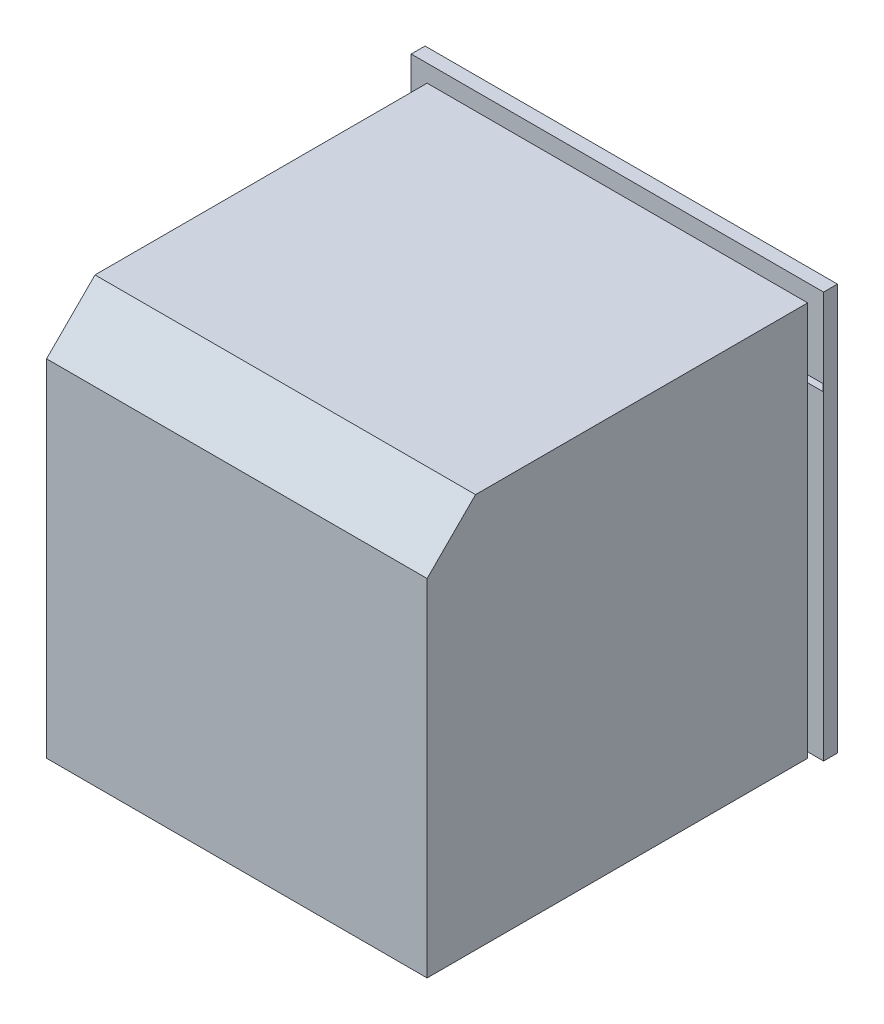
ISO-10303-21;
HEADER;
FILE_DESCRIPTION(('STEP AP214'),'2;1');
FILE_NAME('part.step','',(''),(''),'','','');
FILE_SCHEMA(('AUTOMOTIVE_DESIGN { 1 0 10303 214 1 1 1 1 }'));
ENDSEC;
DATA;
#1=APPLICATION_CONTEXT('core data for automotive mechanical design processes');
#2=APPLICATION_PROTOCOL_DEFINITION('international standard','automotive_design',2000,#1);
#3=PRODUCT_CONTEXT('',#1,'mechanical');
#4=PRODUCT('Part','Part','',(#3));
#5=PRODUCT_RELATED_PRODUCT_CATEGORY('part','',(#4));
#6=PRODUCT_DEFINITION_FORMATION('','',#4);
#7=PRODUCT_DEFINITION_CONTEXT('part definition',#1,'design');
#8=PRODUCT_DEFINITION('design','',#6,#7);
#9=PRODUCT_DEFINITION_SHAPE('','',#8);
#10=(LENGTH_UNIT() NAMED_UNIT(*) SI_UNIT(.MILLI.,.METRE.));
#11=(NAMED_UNIT(*) PLANE_ANGLE_UNIT() SI_UNIT($,.RADIAN.));
#12=(NAMED_UNIT(*) SI_UNIT($,.STERADIAN.) SOLID_ANGLE_UNIT());
#13=UNCERTAINTY_MEASURE_WITH_UNIT(LENGTH_MEASURE(1.E-05),#10,'distance_accuracy_value','');
#14=(GEOMETRIC_REPRESENTATION_CONTEXT(3) GLOBAL_UNCERTAINTY_ASSIGNED_CONTEXT((#13)) GLOBAL_UNIT_ASSIGNED_CONTEXT((#10,
#11,#12)) REPRESENTATION_CONTEXT('',''));
#15=CARTESIAN_POINT('',(0.,0.,0.));
#16=DIRECTION('',(0.,0.,1.));
#17=DIRECTION('',(1.,0.,0.));
#18=AXIS2_PLACEMENT_3D('',#15,#16,#17);
#19=CARTESIAN_POINT('',(-209.116922128555,438.707988465642,-61.3242226126102));
#20=DIRECTION('',(0.,0.,-1.));
#21=DIRECTION('',(-1.,0.,0.));
#22=AXIS2_PLACEMENT_3D('',#19,#20,#21);
#23=PLANE('',#22);
#24=DIRECTION('',(-1.,0.,0.));
#25=VECTOR('',#24,1.);
#26=CARTESIAN_POINT('',(-209.116922128555,468.707988465642,-61.3242226126102));
#27=LINE('',#26,#25);
#28=CARTESIAN_POINT('',(220.883077871445,468.707988465642,-61.3242226126102));
#29=VERTEX_POINT('',#28);
#30=CARTESIAN_POINT('',(-209.116922128555,468.707988465642,-61.3242226126102));
#31=VERTEX_POINT('',#30);
#32=EDGE_CURVE('E156',#29,#31,#27,.T.);
#33=ORIENTED_EDGE('',*,*,#32,.F.);
#34=DIRECTION('',(0.,1.,0.));
#35=VECTOR('',#34,1.);
#36=CARTESIAN_POINT('',(220.883077871445,438.707988465642,-61.3242226126102));
#37=LINE('',#36,#35);
#38=CARTESIAN_POINT('',(220.883077871445,438.707988465642,-61.3242226126102));
#39=VERTEX_POINT('',#38);
#40=EDGE_CURVE('E55',#39,#29,#37,.T.);
#41=ORIENTED_EDGE('',*,*,#40,.F.);
#42=DIRECTION('',(-1.,0.,0.));
#43=VECTOR('',#42,1.);
#44=CARTESIAN_POINT('',(-209.116922128555,438.707988465642,-61.3242226126102));
#45=LINE('',#44,#43);
#46=CARTESIAN_POINT('',(-209.116922128555,438.707988465642,-61.3242226126102));
#47=VERTEX_POINT('',#46);
#48=EDGE_CURVE('E130',#39,#47,#45,.T.);
#49=ORIENTED_EDGE('',*,*,#48,.T.);
#50=DIRECTION('',(0.,1.,0.));
#51=VECTOR('',#50,1.);
#52=CARTESIAN_POINT('',(-209.116922128555,438.707988465642,-61.3242226126102));
#53=LINE('',#52,#51);
#54=EDGE_CURVE('E12',#47,#31,#53,.T.);
#55=ORIENTED_EDGE('',*,*,#54,.T.);
#56=EDGE_LOOP('',(#33,#41,#49,#55));
#57=FACE_BOUND('',#56,.T.);
#58=ADVANCED_FACE('F45',(#57),#23,.T.);
#59=CARTESIAN_POINT('',(220.883077871445,438.707988465642,-61.3242226126102));
#60=DIRECTION('',(1.,0.,0.));
#61=DIRECTION('',(0.,1.,0.));
#62=AXIS2_PLACEMENT_3D('',#59,#60,#61);
#63=PLANE('',#62);
#64=DIRECTION('',(0.,0.,-1.));
#65=VECTOR('',#64,1.);
#66=CARTESIAN_POINT('',(220.883077871445,468.707988465642,-61.3242226126102));
#67=LINE('',#66,#65);
#68=CARTESIAN_POINT('',(220.883077871445,468.707988465642,-20.01));
#69=VERTEX_POINT('',#68);
#70=EDGE_CURVE('E115',#69,#29,#67,.T.);
#71=ORIENTED_EDGE('',*,*,#70,.F.);
#72=DIRECTION('',(0.,1.,0.));
#73=VECTOR('',#72,1.);
#74=CARTESIAN_POINT('',(220.883077871445,438.707988465642,-20.01));
#75=LINE('',#74,#73);
#76=CARTESIAN_POINT('',(220.883077871445,438.707988465642,-20.01));
#77=VERTEX_POINT('',#76);
#78=EDGE_CURVE('E111',#77,#69,#75,.T.);
#79=ORIENTED_EDGE('',*,*,#78,.F.);
#80=DIRECTION('',(0.,0.,-1.));
#81=VECTOR('',#80,1.);
#82=CARTESIAN_POINT('',(220.883077871445,438.707988465642,-46.3242226126102));
#83=LINE('',#82,#81);
#84=EDGE_CURVE('E114',#77,#39,#83,.T.);
#85=ORIENTED_EDGE('',*,*,#84,.T.);
#86=ORIENTED_EDGE('',*,*,#40,.T.);
#87=EDGE_LOOP('',(#71,#79,#85,#86));
#88=FACE_BOUND('',#87,.T.);
#89=ADVANCED_FACE('F113',(#88),#63,.T.);
#90=CARTESIAN_POINT('',(220.883077871445,438.707988465642,-20.01));
#91=DIRECTION('',(0.,0.,1.));
#92=DIRECTION('',(1.,0.,0.));
#93=AXIS2_PLACEMENT_3D('',#90,#91,#92);
#94=PLANE('',#93);
#95=DIRECTION('',(1.,0.,0.));
#96=VECTOR('',#95,1.);
#97=CARTESIAN_POINT('',(220.883077871445,468.707988465642,-20.01));
#98=LINE('',#97,#96);
#99=CARTESIAN_POINT('',(200.883077871445,468.707988465642,-20.01));
#100=VERTEX_POINT('',#99);
#101=EDGE_CURVE('E153',#100,#69,#98,.T.);
#102=ORIENTED_EDGE('',*,*,#101,.F.);
#103=DIRECTION('',(0.,1.,0.));
#104=VECTOR('',#103,1.);
#105=CARTESIAN_POINT('',(200.883077871445,438.707988465642,-20.01));
#106=LINE('',#105,#104);
#107=CARTESIAN_POINT('',(200.883077871445,438.707988465642,-20.01));
#108=VERTEX_POINT('',#107);
#109=EDGE_CURVE('E120',#108,#100,#106,.T.);
#110=ORIENTED_EDGE('',*,*,#109,.F.);
#111=DIRECTION('',(1.,0.,0.));
#112=VECTOR('',#111,1.);
#113=CARTESIAN_POINT('',(220.883077871445,438.707988465642,-20.01));
#114=LINE('',#113,#112);
#115=EDGE_CURVE('E127',#108,#77,#114,.T.);
#116=ORIENTED_EDGE('',*,*,#115,.T.);
#117=ORIENTED_EDGE('',*,*,#78,.T.);
#118=EDGE_LOOP('',(#102,#110,#116,#117));
#119=FACE_BOUND('',#118,.T.);
#120=ADVANCED_FACE('F132',(#119),#94,.T.);
#121=CARTESIAN_POINT('',(200.883077871445,438.707988465642,-46.3242226126102));
#122=DIRECTION('',(-1.,0.,0.));
#123=DIRECTION('',(0.,-1.,0.));
#124=AXIS2_PLACEMENT_3D('',#121,#122,#123);
#125=PLANE('',#124);
#126=DIRECTION('',(0.,0.,1.));
#127=VECTOR('',#126,1.);
#128=CARTESIAN_POINT('',(200.883077871445,468.707988465642,-46.3242226126102));
#129=LINE('',#128,#127);
#130=CARTESIAN_POINT('',(200.883077871445,468.707988465642,-46.3242226126102));
#131=VERTEX_POINT('',#130);
#132=EDGE_CURVE('E150',#131,#100,#129,.T.);
#133=ORIENTED_EDGE('',*,*,#132,.F.);
#134=DIRECTION('',(0.,1.,0.));
#135=VECTOR('',#134,1.);
#136=CARTESIAN_POINT('',(200.883077871445,438.707988465642,-46.3242226126102));
#137=LINE('',#136,#135);
#138=CARTESIAN_POINT('',(200.883077871445,438.707988465642,-46.3242226126102));
#139=VERTEX_POINT('',#138);
#140=EDGE_CURVE('E161',#139,#131,#137,.T.);
#141=ORIENTED_EDGE('',*,*,#140,.F.);
#142=DIRECTION('',(0.,0.,1.));
#143=VECTOR('',#142,1.);
#144=CARTESIAN_POINT('',(200.883077871445,438.707988465642,-46.3242226126102));
#145=LINE('',#144,#143);
#146=EDGE_CURVE('E133',#139,#108,#145,.T.);
#147=ORIENTED_EDGE('',*,*,#146,.T.);
#148=ORIENTED_EDGE('',*,*,#109,.T.);
#149=EDGE_LOOP('',(#133,#141,#147,#148));
#150=FACE_BOUND('',#149,.T.);
#151=ADVANCED_FACE('F186',(#150),#125,.T.);
#152=CARTESIAN_POINT('',(-189.116922128555,438.707988465642,-46.3242226126102));
#153=DIRECTION('',(0.,0.,1.));
#154=DIRECTION('',(1.,0.,0.));
#155=AXIS2_PLACEMENT_3D('',#152,#153,#154);
#156=PLANE('',#155);
#157=DIRECTION('',(1.,0.,0.));
#158=VECTOR('',#157,1.);
#159=CARTESIAN_POINT('',(-189.116922128555,468.707988465642,-46.3242226126102));
#160=LINE('',#159,#158);
#161=CARTESIAN_POINT('',(-189.116922128555,468.707988465642,-46.3242226126102));
#162=VERTEX_POINT('',#161);
#163=EDGE_CURVE('E147',#162,#131,#160,.T.);
#164=ORIENTED_EDGE('',*,*,#163,.F.);
#165=DIRECTION('',(0.,1.,0.));
#166=VECTOR('',#165,1.);
#167=CARTESIAN_POINT('',(-189.116922128555,438.707988465642,-46.3242226126102));
#168=LINE('',#167,#166);
#169=CARTESIAN_POINT('',(-189.116922128555,438.707988465642,-46.3242226126102));
#170=VERTEX_POINT('',#169);
#171=EDGE_CURVE('E163',#170,#162,#168,.T.);
#172=ORIENTED_EDGE('',*,*,#171,.F.);
#173=DIRECTION('',(1.,0.,0.));
#174=VECTOR('',#173,1.);
#175=CARTESIAN_POINT('',(-189.116922128555,438.707988465642,-46.3242226126102));
#176=LINE('',#175,#174);
#177=EDGE_CURVE('E135',#170,#139,#176,.T.);
#178=ORIENTED_EDGE('',*,*,#177,.T.);
#179=ORIENTED_EDGE('',*,*,#140,.T.);
#180=EDGE_LOOP('',(#164,#172,#178,#179));
#181=FACE_BOUND('',#180,.T.);
#182=ADVANCED_FACE('F189',(#181),#156,.T.);
#183=CARTESIAN_POINT('',(-189.116922128555,438.707988465642,-46.3242226126102));
#184=DIRECTION('',(1.,0.,0.));
#185=DIRECTION('',(0.,1.,0.));
#186=AXIS2_PLACEMENT_3D('',#183,#184,#185);
#187=PLANE('',#186);
#188=DIRECTION('',(0.,0.,-1.));
#189=VECTOR('',#188,1.);
#190=CARTESIAN_POINT('',(-189.116922128555,468.707988465642,-46.3242226126102));
#191=LINE('',#190,#189);
#192=CARTESIAN_POINT('',(-189.116922128555,468.707988465642,-20.01));
#193=VERTEX_POINT('',#192);
#194=EDGE_CURVE('E144',#193,#162,#191,.T.);
#195=ORIENTED_EDGE('',*,*,#194,.F.);
#196=DIRECTION('',(0.,1.,0.));
#197=VECTOR('',#196,1.);
#198=CARTESIAN_POINT('',(-189.116922128555,438.707988465642,-20.01));
#199=LINE('',#198,#197);
#200=CARTESIAN_POINT('',(-189.116922128555,438.707988465642,-20.01));
#201=VERTEX_POINT('',#200);
#202=EDGE_CURVE('E164',#201,#193,#199,.T.);
#203=ORIENTED_EDGE('',*,*,#202,.F.);
#204=DIRECTION('',(0.,0.,-1.));
#205=VECTOR('',#204,1.);
#206=CARTESIAN_POINT('',(-189.116922128555,438.707988465642,-46.3242226126102));
#207=LINE('',#206,#205);
#208=EDGE_CURVE('E273',#201,#170,#207,.T.);
#209=ORIENTED_EDGE('',*,*,#208,.T.);
#210=ORIENTED_EDGE('',*,*,#171,.T.);
#211=EDGE_LOOP('',(#195,#203,#209,#210));
#212=FACE_BOUND('',#211,.T.);
#213=ADVANCED_FACE('F193',(#212),#187,.T.);
#214=CARTESIAN_POINT('',(-209.116922128555,438.707988465642,-20.01));
#215=DIRECTION('',(0.,0.,1.));
#216=DIRECTION('',(1.,0.,0.));
#217=AXIS2_PLACEMENT_3D('',#214,#215,#216);
#218=PLANE('',#217);
#219=DIRECTION('',(1.,0.,0.));
#220=VECTOR('',#219,1.);
#221=CARTESIAN_POINT('',(-209.116922128555,468.707988465642,-20.01));
#222=LINE('',#221,#220);
#223=CARTESIAN_POINT('',(-209.116922128555,468.707988465642,-20.01));
#224=VERTEX_POINT('',#223);
#225=EDGE_CURVE('E141',#224,#193,#222,.T.);
#226=ORIENTED_EDGE('',*,*,#225,.F.);
#227=DIRECTION('',(0.,1.,0.));
#228=VECTOR('',#227,1.);
#229=CARTESIAN_POINT('',(-209.116922128555,438.707988465642,-20.01));
#230=LINE('',#229,#228);
#231=CARTESIAN_POINT('',(-209.116922128555,438.707988465642,-20.01));
#232=VERTEX_POINT('',#231);
#233=EDGE_CURVE('E49',#232,#224,#230,.T.);
#234=ORIENTED_EDGE('',*,*,#233,.F.);
#235=DIRECTION('',(1.,0.,0.));
#236=VECTOR('',#235,1.);
#237=CARTESIAN_POINT('',(-209.116922128555,438.707988465642,-20.01));
#238=LINE('',#237,#236);
#239=EDGE_CURVE('E274',#232,#201,#238,.T.);
#240=ORIENTED_EDGE('',*,*,#239,.T.);
#241=ORIENTED_EDGE('',*,*,#202,.T.);
#242=EDGE_LOOP('',(#226,#234,#240,#241));
#243=FACE_BOUND('',#242,.T.);
#244=ADVANCED_FACE('F170',(#243),#218,.T.);
#245=CARTESIAN_POINT('',(-209.116922128555,438.707988465642,-46.3242226126102));
#246=DIRECTION('',(-1.,0.,0.));
#247=DIRECTION('',(0.,-1.,0.));
#248=AXIS2_PLACEMENT_3D('',#245,#246,#247);
#249=PLANE('',#248);
#250=DIRECTION('',(0.,0.,1.));
#251=VECTOR('',#250,1.);
#252=CARTESIAN_POINT('',(-209.116922128555,468.707988465642,-46.3242226126102));
#253=LINE('',#252,#251);
#254=EDGE_CURVE('E93',#31,#224,#253,.T.);
#255=ORIENTED_EDGE('',*,*,#254,.F.);
#256=ORIENTED_EDGE('',*,*,#54,.F.);
#257=DIRECTION('',(0.,0.,1.));
#258=VECTOR('',#257,1.);
#259=CARTESIAN_POINT('',(-209.116922128555,438.707988465642,-61.3242226126102));
#260=LINE('',#259,#258);
#261=EDGE_CURVE('E96',#47,#232,#260,.T.);
#262=ORIENTED_EDGE('',*,*,#261,.T.);
#263=ORIENTED_EDGE('',*,*,#233,.T.);
#264=EDGE_LOOP('',(#255,#256,#262,#263));
#265=FACE_BOUND('',#264,.T.);
#266=ADVANCED_FACE('F47',(#265),#249,.T.);
#267=CARTESIAN_POINT('',(0.,438.707988465642,0.));
#268=DIRECTION('',(0.,1.,0.));
#269=DIRECTION('',(0.,0.,1.));
#270=AXIS2_PLACEMENT_3D('',#267,#268,#269);
#271=PLANE('',#270);
#272=ORIENTED_EDGE('',*,*,#261,.F.);
#273=ORIENTED_EDGE('',*,*,#48,.F.);
#274=ORIENTED_EDGE('',*,*,#84,.F.);
#275=ORIENTED_EDGE('',*,*,#115,.F.);
#276=ORIENTED_EDGE('',*,*,#146,.F.);
#277=ORIENTED_EDGE('',*,*,#177,.F.);
#278=ORIENTED_EDGE('',*,*,#208,.F.);
#279=ORIENTED_EDGE('',*,*,#239,.F.);
#280=EDGE_LOOP('',(#272,#273,#274,#275,#276,#277,#278,#279));
#281=FACE_BOUND('',#280,.T.);
#282=ADVANCED_FACE('F125',(#281),#271,.F.);
#283=CARTESIAN_POINT('',(0.,468.707988465642,0.));
#284=DIRECTION('',(0.,1.,0.));
#285=DIRECTION('',(0.,0.,1.));
#286=AXIS2_PLACEMENT_3D('',#283,#284,#285);
#287=PLANE('',#286);
#288=ORIENTED_EDGE('',*,*,#32,.T.);
#289=ORIENTED_EDGE('',*,*,#254,.T.);
#290=ORIENTED_EDGE('',*,*,#225,.T.);
#291=ORIENTED_EDGE('',*,*,#194,.T.);
#292=ORIENTED_EDGE('',*,*,#163,.T.);
#293=ORIENTED_EDGE('',*,*,#132,.T.);
#294=ORIENTED_EDGE('',*,*,#101,.T.);
#295=ORIENTED_EDGE('',*,*,#70,.T.);
#296=EDGE_LOOP('',(#288,#289,#290,#291,#292,#293,#294,#295));
#297=FACE_BOUND('',#296,.T.);
#298=ADVANCED_FACE('F172',(#297),#287,.T.);
#299=CLOSED_SHELL('',(#58,#89,#120,#151,#182,#213,#244,#266,#282,#298));
#300=MANIFOLD_SOLID_BREP('B2',#299);
#301=CARTESIAN_POINT('',(275.,8.70798846564201,550.));
#302=DIRECTION('',(0.,1.,0.));
#303=DIRECTION('',(-1.,0.,0.));
#304=AXIS2_PLACEMENT_3D('',#301,#302,#303);
#305=PLANE('',#304);
#306=DIRECTION('',(-1.,0.,0.));
#307=VECTOR('',#306,1.);
#308=CARTESIAN_POINT('',(-298.,8.70798846564191,-20.));
#309=LINE('',#308,#307);
#310=CARTESIAN_POINT('',(-297.,8.70798846564184,-20.));
#311=VERTEX_POINT('',#310);
#312=CARTESIAN_POINT('',(-298.,8.70798846564191,-20.));
#313=VERTEX_POINT('',#312);
#314=EDGE_CURVE('E536',#311,#313,#309,.T.);
#315=ORIENTED_EDGE('',*,*,#314,.F.);
#316=DIRECTION('',(0.,0.,-1.));
#317=VECTOR('',#316,1.);
#318=CARTESIAN_POINT('',(-297.,8.70798846564184,0.));
#319=LINE('',#318,#317);
#320=CARTESIAN_POINT('',(-297.,8.70798846564184,0.));
#321=VERTEX_POINT('',#320);
#322=EDGE_CURVE('E484',#321,#311,#319,.T.);
#323=ORIENTED_EDGE('',*,*,#322,.F.);
#324=DIRECTION('',(-1.,0.,0.));
#325=VECTOR('',#324,1.);
#326=CARTESIAN_POINT('',(-298.,8.70798846564191,0.));
#327=LINE('',#326,#325);
#328=CARTESIAN_POINT('',(-298.,8.70798846564191,0.));
#329=VERTEX_POINT('',#328);
#330=EDGE_CURVE('E570',#321,#329,#327,.T.);
#331=ORIENTED_EDGE('',*,*,#330,.T.);
#332=DIRECTION('',(0.,0.,1.));
#333=VECTOR('',#332,1.);
#334=CARTESIAN_POINT('',(-298.,8.70798846564191,-20.));
#335=LINE('',#334,#333);
#336=EDGE_CURVE('E645',#313,#329,#335,.T.);
#337=ORIENTED_EDGE('',*,*,#336,.F.);
#338=EDGE_LOOP('',(#315,#323,#331,#337));
#339=FACE_BOUND('',#338,.T.);
#340=ADVANCED_FACE('F281',(#339),#305,.F.);
#341=CARTESIAN_POINT('',(0.,0.,-20.));
#342=DIRECTION('',(0.,0.,-1.));
#343=DIRECTION('',(-1.,0.,0.));
#344=AXIS2_PLACEMENT_3D('',#341,#342,#343);
#345=PLANE('',#344);
#346=DIRECTION('',(0.,1.,0.));
#347=VECTOR('',#346,1.);
#348=CARTESIAN_POINT('',(-297.,0.,-20.));
#349=LINE('',#348,#347);
#350=CARTESIAN_POINT('',(-297.,478.707988465642,-20.));
#351=VERTEX_POINT('',#350);
#352=CARTESIAN_POINT('',(-297.,488.707988465642,-20.));
#353=VERTEX_POINT('',#352);
#354=EDGE_CURVE('E438',#351,#353,#349,.T.);
#355=ORIENTED_EDGE('',*,*,#354,.F.);
#356=DIRECTION('',(-1.,0.,0.));
#357=VECTOR('',#356,1.);
#358=CARTESIAN_POINT('',(0.,478.707988465642,-20.));
#359=LINE('',#358,#357);
#360=CARTESIAN_POINT('',(297.,478.707988465642,-20.));
#361=VERTEX_POINT('',#360);
#362=EDGE_CURVE('E470',#361,#351,#359,.T.);
#363=ORIENTED_EDGE('',*,*,#362,.F.);
#364=DIRECTION('',(0.,-1.,0.));
#365=VECTOR('',#364,1.);
#366=CARTESIAN_POINT('',(297.,0.,-20.));
#367=LINE('',#366,#365);
#368=CARTESIAN_POINT('',(297.,488.707988465642,-20.));
#369=VERTEX_POINT('',#368);
#370=EDGE_CURVE('E468',#369,#361,#367,.T.);
#371=ORIENTED_EDGE('',*,*,#370,.F.);
#372=DIRECTION('',(1.,0.,0.));
#373=VECTOR('',#372,1.);
#374=CARTESIAN_POINT('',(0.,488.707988465642,-20.));
#375=LINE('',#374,#373);
#376=EDGE_CURVE('E462',#353,#369,#375,.T.);
#377=ORIENTED_EDGE('',*,*,#376,.F.);
#378=EDGE_LOOP('',(#355,#363,#371,#377));
#379=FACE_BOUND('',#378,.T.);
#380=DIRECTION('',(0.,1.,0.));
#381=VECTOR('',#380,1.);
#382=CARTESIAN_POINT('',(-298.,8.70798846564191,-20.));
#383=LINE('',#382,#381);
#384=CARTESIAN_POINT('',(-298.,585.707988465642,-20.));
#385=VERTEX_POINT('',#384);
#386=EDGE_CURVE('E543',#313,#385,#383,.T.);
#387=ORIENTED_EDGE('',*,*,#386,.T.);
#388=DIRECTION('',(-1.,0.,0.));
#389=VECTOR('',#388,1.);
#390=CARTESIAN_POINT('',(298.,585.707988465642,-20.));
#391=LINE('',#390,#389);
#392=CARTESIAN_POINT('',(298.,585.707988465642,-20.));
#393=VERTEX_POINT('',#392);
#394=EDGE_CURVE('E492',#393,#385,#391,.T.);
#395=ORIENTED_EDGE('',*,*,#394,.F.);
#396=DIRECTION('',(0.,-1.,0.));
#397=VECTOR('',#396,1.);
#398=CARTESIAN_POINT('',(298.,8.70798846564184,-20.));
#399=LINE('',#398,#397);
#400=CARTESIAN_POINT('',(298.,60.7079884656419,-20.));
#401=VERTEX_POINT('',#400);
#402=EDGE_CURVE('E534',#393,#401,#399,.T.);
#403=ORIENTED_EDGE('',*,*,#402,.T.);
#404=DIRECTION('',(1.,0.,0.));
#405=VECTOR('',#404,1.);
#406=CARTESIAN_POINT('',(-297.,60.7079884656419,-20.));
#407=LINE('',#406,#405);
#408=CARTESIAN_POINT('',(-297.,60.7079884656419,-20.));
#409=VERTEX_POINT('',#408);
#410=EDGE_CURVE('E514',#409,#401,#407,.T.);
#411=ORIENTED_EDGE('',*,*,#410,.F.);
#412=DIRECTION('',(0.,1.,0.));
#413=VECTOR('',#412,1.);
#414=CARTESIAN_POINT('',(-297.,60.7079884656419,-20.));
#415=LINE('',#414,#413);
#416=CARTESIAN_POINT('',(-297.,16.7079884656418,-20.));
#417=VERTEX_POINT('',#416);
#418=EDGE_CURVE('E509',#417,#409,#415,.T.);
#419=ORIENTED_EDGE('',*,*,#418,.F.);
#420=EDGE_CURVE('E527',#311,#417,#415,.T.);
#421=ORIENTED_EDGE('',*,*,#420,.F.);
#422=ORIENTED_EDGE('',*,*,#314,.T.);
#423=EDGE_LOOP('',(#387,#395,#403,#411,#419,#421,#422));
#424=FACE_BOUND('',#423,.T.);
#425=ADVANCED_FACE('F563',(#379,#424),#345,.T.);
#426=CARTESIAN_POINT('',(-275.,8.70798846564191,550.));
#427=DIRECTION('',(1.,0.,0.));
#428=DIRECTION('',(0.,0.,-1.));
#429=AXIS2_PLACEMENT_3D('',#426,#427,#428);
#430=PLANE('',#429);
#431=DIRECTION('',(0.,-1.,0.));
#432=VECTOR('',#431,1.);
#433=CARTESIAN_POINT('',(-275.,8.70798846564191,550.));
#434=LINE('',#433,#432);
#435=CARTESIAN_POINT('',(-275.,508.707988465642,550.));
#436=VERTEX_POINT('',#435);
#437=CARTESIAN_POINT('',(-275.,8.70798846564191,550.));
#438=VERTEX_POINT('',#437);
#439=EDGE_CURVE('E660',#436,#438,#434,.T.);
#440=ORIENTED_EDGE('',*,*,#439,.F.);
#441=DIRECTION('',(0.,0.707106781186546,-0.707106781186549));
#442=VECTOR('',#441,1.);
#443=CARTESIAN_POINT('',(-275.,508.707988465642,550.));
#444=LINE('',#443,#442);
#445=CARTESIAN_POINT('',(-275.,578.707988465642,480.));
#446=VERTEX_POINT('',#445);
#447=EDGE_CURVE('E613',#436,#446,#444,.T.);
#448=ORIENTED_EDGE('',*,*,#447,.T.);
#449=DIRECTION('',(0.,0.,-1.));
#450=VECTOR('',#449,1.);
#451=CARTESIAN_POINT('',(-275.,578.707988465642,550.));
#452=LINE('',#451,#450);
#453=CARTESIAN_POINT('',(-275.,578.707988465642,0.));
#454=VERTEX_POINT('',#453);
#455=EDGE_CURVE('E663',#446,#454,#452,.T.);
#456=ORIENTED_EDGE('',*,*,#455,.T.);
#457=DIRECTION('',(0.,-1.,0.));
#458=VECTOR('',#457,1.);
#459=CARTESIAN_POINT('',(-275.,8.70798846564191,0.));
#460=LINE('',#459,#458);
#461=CARTESIAN_POINT('',(-275.,488.707988465642,0.));
#462=VERTEX_POINT('',#461);
#463=EDGE_CURVE('E547',#454,#462,#460,.T.);
#464=ORIENTED_EDGE('',*,*,#463,.T.);
#465=CARTESIAN_POINT('',(-275.,478.707988465642,0.));
#466=VERTEX_POINT('',#465);
#467=EDGE_CURVE('E633',#462,#466,#460,.T.);
#468=ORIENTED_EDGE('',*,*,#467,.T.);
#469=CARTESIAN_POINT('',(-275.,16.7079884656418,0.));
#470=VERTEX_POINT('',#469);
#471=EDGE_CURVE('E632',#466,#470,#460,.T.);
#472=ORIENTED_EDGE('',*,*,#471,.T.);
#473=CARTESIAN_POINT('',(-275.,8.70798846564184,0.));
#474=VERTEX_POINT('',#473);
#475=EDGE_CURVE('E634',#470,#474,#460,.T.);
#476=ORIENTED_EDGE('',*,*,#475,.T.);
#477=DIRECTION('',(0.,0.,-1.));
#478=VECTOR('',#477,1.);
#479=CARTESIAN_POINT('',(-275.,8.70798846564191,550.));
#480=LINE('',#479,#478);
#481=EDGE_CURVE('E601',#438,#474,#480,.T.);
#482=ORIENTED_EDGE('',*,*,#481,.F.);
#483=EDGE_LOOP('',(#440,#448,#456,#464,#468,#472,#476,#482));
#484=FACE_BOUND('',#483,.T.);
#485=ADVANCED_FACE('F674',(#484),#430,.F.);
#486=ORIENTED_EDGE('',*,*,#481,.T.);
#487=DIRECTION('',(-1.,0.,0.));
#488=VECTOR('',#487,1.);
#489=CARTESIAN_POINT('',(298.,8.70798846564184,0.));
#490=LINE('',#489,#488);
#491=CARTESIAN_POINT('',(275.,8.70798846564184,0.));
#492=VERTEX_POINT('',#491);
#493=EDGE_CURVE('E479',#492,#474,#490,.T.);
#494=ORIENTED_EDGE('',*,*,#493,.F.);
#495=DIRECTION('',(0.,0.,-1.));
#496=VECTOR('',#495,1.);
#497=CARTESIAN_POINT('',(275.,8.70798846564201,550.));
#498=LINE('',#497,#496);
#499=CARTESIAN_POINT('',(275.,8.70798846564201,550.));
#500=VERTEX_POINT('',#499);
#501=EDGE_CURVE('E595',#500,#492,#498,.T.);
#502=ORIENTED_EDGE('',*,*,#501,.F.);
#503=DIRECTION('',(1.,0.,0.));
#504=VECTOR('',#503,1.);
#505=CARTESIAN_POINT('',(275.,8.70798846564201,550.));
#506=LINE('',#505,#504);
#507=EDGE_CURVE('E661',#438,#500,#506,.T.);
#508=ORIENTED_EDGE('',*,*,#507,.F.);
#509=EDGE_LOOP('',(#486,#494,#502,#508));
#510=FACE_BOUND('',#509,.T.);
#511=ADVANCED_FACE('F676',(#510),#305,.F.);
#512=CARTESIAN_POINT('',(275.,8.70798846564201,550.));
#513=DIRECTION('',(-1.,0.,0.));
#514=DIRECTION('',(0.,0.,1.));
#515=AXIS2_PLACEMENT_3D('',#512,#513,#514);
#516=PLANE('',#515);
#517=DIRECTION('',(0.,0.,-1.));
#518=VECTOR('',#517,1.);
#519=CARTESIAN_POINT('',(275.,578.707988465642,550.));
#520=LINE('',#519,#518);
#521=CARTESIAN_POINT('',(275.,578.707988465642,480.));
#522=VERTEX_POINT('',#521);
#523=CARTESIAN_POINT('',(275.,578.707988465642,0.));
#524=VERTEX_POINT('',#523);
#525=EDGE_CURVE('E602',#522,#524,#520,.T.);
#526=ORIENTED_EDGE('',*,*,#525,.F.);
#527=DIRECTION('',(0.,-0.707106781186546,0.707106781186549));
#528=VECTOR('',#527,1.);
#529=CARTESIAN_POINT('',(275.,508.707988465642,550.));
#530=LINE('',#529,#528);
#531=CARTESIAN_POINT('',(275.,508.707988465642,550.));
#532=VERTEX_POINT('',#531);
#533=EDGE_CURVE('E624',#522,#532,#530,.T.);
#534=ORIENTED_EDGE('',*,*,#533,.T.);
#535=DIRECTION('',(0.,1.,0.));
#536=VECTOR('',#535,1.);
#537=CARTESIAN_POINT('',(275.,8.70798846564201,550.));
#538=LINE('',#537,#536);
#539=EDGE_CURVE('E638',#500,#532,#538,.T.);
#540=ORIENTED_EDGE('',*,*,#539,.F.);
#541=ORIENTED_EDGE('',*,*,#501,.T.);
#542=DIRECTION('',(0.,1.,0.));
#543=VECTOR('',#542,1.);
#544=CARTESIAN_POINT('',(275.,8.70798846564201,0.));
#545=LINE('',#544,#543);
#546=CARTESIAN_POINT('',(275.,16.7079884656418,0.));
#547=VERTEX_POINT('',#546);
#548=EDGE_CURVE('E593',#492,#547,#545,.T.);
#549=ORIENTED_EDGE('',*,*,#548,.T.);
#550=CARTESIAN_POINT('',(275.,478.707988465642,0.));
#551=VERTEX_POINT('',#550);
#552=EDGE_CURVE('E583',#547,#551,#545,.T.);
#553=ORIENTED_EDGE('',*,*,#552,.T.);
#554=CARTESIAN_POINT('',(275.,488.707988465642,0.));
#555=VERTEX_POINT('',#554);
#556=EDGE_CURVE('E585',#551,#555,#545,.T.);
#557=ORIENTED_EDGE('',*,*,#556,.T.);
#558=EDGE_CURVE('E588',#555,#524,#545,.T.);
#559=ORIENTED_EDGE('',*,*,#558,.T.);
#560=EDGE_LOOP('',(#526,#534,#540,#541,#549,#553,#557,#559));
#561=FACE_BOUND('',#560,.T.);
#562=ADVANCED_FACE('F672',(#561),#516,.F.);
#563=CARTESIAN_POINT('',(275.,578.707988465642,550.));
#564=DIRECTION('',(0.,-1.,0.));
#565=DIRECTION('',(0.,0.,-1.));
#566=AXIS2_PLACEMENT_3D('',#563,#564,#565);
#567=PLANE('',#566);
#568=ORIENTED_EDGE('',*,*,#455,.F.);
#569=DIRECTION('',(1.,0.,0.));
#570=VECTOR('',#569,1.);
#571=CARTESIAN_POINT('',(275.,578.707988465642,480.));
#572=LINE('',#571,#570);
#573=EDGE_CURVE('E619',#446,#522,#572,.T.);
#574=ORIENTED_EDGE('',*,*,#573,.T.);
#575=ORIENTED_EDGE('',*,*,#525,.T.);
#576=DIRECTION('',(-1.,0.,0.));
#577=VECTOR('',#576,1.);
#578=CARTESIAN_POINT('',(275.,578.707988465642,0.));
#579=LINE('',#578,#577);
#580=EDGE_CURVE('E640',#524,#454,#579,.T.);
#581=ORIENTED_EDGE('',*,*,#580,.T.);
#582=EDGE_LOOP('',(#568,#574,#575,#581));
#583=FACE_BOUND('',#582,.T.);
#584=ADVANCED_FACE('F669',(#583),#567,.F.);
#585=CARTESIAN_POINT('',(0.,0.,550.));
#586=DIRECTION('',(0.,0.,1.));
#587=DIRECTION('',(1.,0.,0.));
#588=AXIS2_PLACEMENT_3D('',#585,#586,#587);
#589=PLANE('',#588);
#590=ORIENTED_EDGE('',*,*,#539,.T.);
#591=DIRECTION('',(-1.,0.,0.));
#592=VECTOR('',#591,1.);
#593=CARTESIAN_POINT('',(-275.,508.707988465642,550.));
#594=LINE('',#593,#592);
#595=EDGE_CURVE('E606',#532,#436,#594,.T.);
#596=ORIENTED_EDGE('',*,*,#595,.T.);
#597=ORIENTED_EDGE('',*,*,#439,.T.);
#598=ORIENTED_EDGE('',*,*,#507,.T.);
#599=EDGE_LOOP('',(#590,#596,#597,#598));
#600=FACE_BOUND('',#599,.T.);
#601=ADVANCED_FACE('F675',(#600),#589,.T.);
#602=CARTESIAN_POINT('',(0.,508.707988465642,550.));
#603=DIRECTION('',(0.,0.707106781186549,0.707106781186546));
#604=DIRECTION('',(1.,0.,0.));
#605=AXIS2_PLACEMENT_3D('',#602,#603,#604);
#606=PLANE('',#605);
#607=ORIENTED_EDGE('',*,*,#533,.F.);
#608=ORIENTED_EDGE('',*,*,#573,.F.);
#609=ORIENTED_EDGE('',*,*,#447,.F.);
#610=ORIENTED_EDGE('',*,*,#595,.F.);
#611=EDGE_LOOP('',(#607,#608,#609,#610));
#612=FACE_BOUND('',#611,.T.);
#613=ADVANCED_FACE('F283',(#612),#606,.T.);
#614=CARTESIAN_POINT('',(298.,8.70798846564184,-20.));
#615=DIRECTION('',(-1.,0.,0.));
#616=DIRECTION('',(0.,-1.,0.));
#617=AXIS2_PLACEMENT_3D('',#614,#615,#616);
#618=PLANE('',#617);
#619=DIRECTION('',(0.,-1.,0.));
#620=VECTOR('',#619,1.);
#621=CARTESIAN_POINT('',(298.,8.70798846564184,0.));
#622=LINE('',#621,#620);
#623=CARTESIAN_POINT('',(298.,603.707988465642,0.));
#624=VERTEX_POINT('',#623);
#625=CARTESIAN_POINT('',(298.,16.7079884656418,0.));
#626=VERTEX_POINT('',#625);
#627=EDGE_CURVE('E568',#624,#626,#622,.T.);
#628=ORIENTED_EDGE('',*,*,#627,.T.);
#629=DIRECTION('',(0.,0.,-1.));
#630=VECTOR('',#629,1.);
#631=CARTESIAN_POINT('',(298.,16.7079884656418,0.));
#632=LINE('',#631,#630);
#633=CARTESIAN_POINT('',(298.,16.7079884656418,-20.01));
#634=VERTEX_POINT('',#633);
#635=EDGE_CURVE('E503',#626,#634,#632,.T.);
#636=ORIENTED_EDGE('',*,*,#635,.T.);
#637=DIRECTION('',(0.,-1.,0.));
#638=VECTOR('',#637,1.);
#639=CARTESIAN_POINT('',(298.,60.7079884656418,-20.01));
#640=LINE('',#639,#638);
#641=CARTESIAN_POINT('',(298.,60.7079884656418,-20.01));
#642=VERTEX_POINT('',#641);
#643=EDGE_CURVE('E510',#642,#634,#640,.T.);
#644=ORIENTED_EDGE('',*,*,#643,.F.);
#645=DIRECTION('',(0.,0.,1.));
#646=VECTOR('',#645,1.);
#647=CARTESIAN_POINT('',(298.,60.7079884656418,-20.01));
#648=LINE('',#647,#646);
#649=EDGE_CURVE('E518',#642,#401,#648,.T.);
#650=ORIENTED_EDGE('',*,*,#649,.T.);
#651=ORIENTED_EDGE('',*,*,#402,.F.);
#652=DIRECTION('',(0.,0.,1.));
#653=VECTOR('',#652,1.);
#654=CARTESIAN_POINT('',(298.,585.707988465642,-20.01));
#655=LINE('',#654,#653);
#656=CARTESIAN_POINT('',(298.,585.707988465642,-20.01));
#657=VERTEX_POINT('',#656);
#658=EDGE_CURVE('E506',#657,#393,#655,.T.);
#659=ORIENTED_EDGE('',*,*,#658,.F.);
#660=DIRECTION('',(0.,-1.,0.));
#661=VECTOR('',#660,1.);
#662=CARTESIAN_POINT('',(298.,603.707988465642,-20.01));
#663=LINE('',#662,#661);
#664=CARTESIAN_POINT('',(298.,603.707988465642,-20.01));
#665=VERTEX_POINT('',#664);
#666=EDGE_CURVE('E488',#665,#657,#663,.T.);
#667=ORIENTED_EDGE('',*,*,#666,.F.);
#668=DIRECTION('',(0.,0.,1.));
#669=VECTOR('',#668,1.);
#670=CARTESIAN_POINT('',(298.,603.707988465642,-20.));
#671=LINE('',#670,#669);
#672=EDGE_CURVE('E656',#665,#624,#671,.T.);
#673=ORIENTED_EDGE('',*,*,#672,.T.);
#674=EDGE_LOOP('',(#628,#636,#644,#650,#651,#659,#667,#673));
#675=FACE_BOUND('',#674,.T.);
#676=ADVANCED_FACE('F709',(#675),#618,.F.);
#677=CARTESIAN_POINT('',(-298.,8.70798846564191,-20.));
#678=DIRECTION('',(1.,0.,0.));
#679=DIRECTION('',(0.,0.,-1.));
#680=AXIS2_PLACEMENT_3D('',#677,#678,#679);
#681=PLANE('',#680);
#682=DIRECTION('',(0.,1.,0.));
#683=VECTOR('',#682,1.);
#684=CARTESIAN_POINT('',(-298.,8.70798846564191,0.));
#685=LINE('',#684,#683);
#686=CARTESIAN_POINT('',(-298.,603.707988465642,0.));
#687=VERTEX_POINT('',#686);
#688=EDGE_CURVE('E575',#329,#687,#685,.T.);
#689=ORIENTED_EDGE('',*,*,#688,.T.);
#690=DIRECTION('',(0.,0.,1.));
#691=VECTOR('',#690,1.);
#692=CARTESIAN_POINT('',(-298.,603.707988465642,-20.));
#693=LINE('',#692,#691);
#694=CARTESIAN_POINT('',(-298.,603.707988465642,-20.01));
#695=VERTEX_POINT('',#694);
#696=EDGE_CURVE('E649',#695,#687,#693,.T.);
#697=ORIENTED_EDGE('',*,*,#696,.F.);
#698=DIRECTION('',(0.,1.,0.));
#699=VECTOR('',#698,1.);
#700=CARTESIAN_POINT('',(-298.,603.707988465642,-20.01));
#701=LINE('',#700,#699);
#702=CARTESIAN_POINT('',(-298.,585.707988465642,-20.01));
#703=VERTEX_POINT('',#702);
#704=EDGE_CURVE('E494',#703,#695,#701,.T.);
#705=ORIENTED_EDGE('',*,*,#704,.F.);
#706=DIRECTION('',(0.,0.,1.));
#707=VECTOR('',#706,1.);
#708=CARTESIAN_POINT('',(-298.,585.707988465642,-20.01));
#709=LINE('',#708,#707);
#710=EDGE_CURVE('E500',#703,#385,#709,.T.);
#711=ORIENTED_EDGE('',*,*,#710,.T.);
#712=ORIENTED_EDGE('',*,*,#386,.F.);
#713=ORIENTED_EDGE('',*,*,#336,.T.);
#714=EDGE_LOOP('',(#689,#697,#705,#711,#712,#713));
#715=FACE_BOUND('',#714,.T.);
#716=ADVANCED_FACE('F721',(#715),#681,.F.);
#717=CARTESIAN_POINT('',(-298.,603.707988465642,-20.));
#718=DIRECTION('',(0.,-1.,0.));
#719=DIRECTION('',(0.,0.,-1.));
#720=AXIS2_PLACEMENT_3D('',#717,#718,#719);
#721=PLANE('',#720);
#722=DIRECTION('',(1.,0.,0.));
#723=VECTOR('',#722,1.);
#724=CARTESIAN_POINT('',(-298.,603.707988465642,0.));
#725=LINE('',#724,#723);
#726=EDGE_CURVE('E537',#687,#624,#725,.T.);
#727=ORIENTED_EDGE('',*,*,#726,.T.);
#728=ORIENTED_EDGE('',*,*,#672,.F.);
#729=DIRECTION('',(1.,0.,0.));
#730=VECTOR('',#729,1.);
#731=CARTESIAN_POINT('',(298.,603.707988465642,-20.01));
#732=LINE('',#731,#730);
#733=EDGE_CURVE('E497',#695,#665,#732,.T.);
#734=ORIENTED_EDGE('',*,*,#733,.F.);
#735=ORIENTED_EDGE('',*,*,#696,.T.);
#736=EDGE_LOOP('',(#727,#728,#734,#735));
#737=FACE_BOUND('',#736,.T.);
#738=ADVANCED_FACE('F722',(#737),#721,.F.);
#739=CARTESIAN_POINT('',(0.,0.,0.));
#740=DIRECTION('',(0.,0.,-1.));
#741=DIRECTION('',(-1.,0.,0.));
#742=AXIS2_PLACEMENT_3D('',#739,#740,#741);
#743=PLANE('',#742);
#744=ORIENTED_EDGE('',*,*,#471,.F.);
#745=DIRECTION('',(-1.,0.,0.));
#746=VECTOR('',#745,1.);
#747=CARTESIAN_POINT('',(0.,478.707988465642,0.));
#748=LINE('',#747,#746);
#749=CARTESIAN_POINT('',(-297.,478.707988465642,0.));
#750=VERTEX_POINT('',#749);
#751=EDGE_CURVE('E43',#466,#750,#748,.T.);
#752=ORIENTED_EDGE('',*,*,#751,.T.);
#753=DIRECTION('',(0.,1.,0.));
#754=VECTOR('',#753,1.);
#755=CARTESIAN_POINT('',(-297.,478.707988465642,0.));
#756=LINE('',#755,#754);
#757=CARTESIAN_POINT('',(-297.,488.707988465642,0.));
#758=VERTEX_POINT('',#757);
#759=EDGE_CURVE('E436',#750,#758,#756,.T.);
#760=ORIENTED_EDGE('',*,*,#759,.T.);
#761=DIRECTION('',(1.,0.,0.));
#762=VECTOR('',#761,1.);
#763=CARTESIAN_POINT('',(-297.,488.707988465642,0.));
#764=LINE('',#763,#762);
#765=EDGE_CURVE('E444',#758,#462,#764,.T.);
#766=ORIENTED_EDGE('',*,*,#765,.T.);
#767=ORIENTED_EDGE('',*,*,#463,.F.);
#768=ORIENTED_EDGE('',*,*,#580,.F.);
#769=ORIENTED_EDGE('',*,*,#558,.F.);
#770=DIRECTION('',(1.,0.,0.));
#771=VECTOR('',#770,1.);
#772=CARTESIAN_POINT('',(0.,488.707988465642,0.));
#773=LINE('',#772,#771);
#774=CARTESIAN_POINT('',(297.,488.707988465642,0.));
#775=VERTEX_POINT('',#774);
#776=EDGE_CURVE('E289',#555,#775,#773,.T.);
#777=ORIENTED_EDGE('',*,*,#776,.T.);
#778=DIRECTION('',(0.,-1.,0.));
#779=VECTOR('',#778,1.);
#780=CARTESIAN_POINT('',(297.,478.707988465642,0.));
#781=LINE('',#780,#779);
#782=CARTESIAN_POINT('',(297.,478.707988465642,0.));
#783=VERTEX_POINT('',#782);
#784=EDGE_CURVE('E304',#775,#783,#781,.T.);
#785=ORIENTED_EDGE('',*,*,#784,.T.);
#786=DIRECTION('',(-1.,0.,0.));
#787=VECTOR('',#786,1.);
#788=CARTESIAN_POINT('',(-297.,478.707988465642,0.));
#789=LINE('',#788,#787);
#790=EDGE_CURVE('E441',#783,#551,#789,.T.);
#791=ORIENTED_EDGE('',*,*,#790,.T.);
#792=ORIENTED_EDGE('',*,*,#552,.F.);
#793=DIRECTION('',(1.,0.,0.));
#794=VECTOR('',#793,1.);
#795=CARTESIAN_POINT('',(298.,16.7079884656418,0.));
#796=LINE('',#795,#794);
#797=EDGE_CURVE('E688',#547,#626,#796,.T.);
#798=ORIENTED_EDGE('',*,*,#797,.T.);
#799=ORIENTED_EDGE('',*,*,#627,.F.);
#800=ORIENTED_EDGE('',*,*,#726,.F.);
#801=ORIENTED_EDGE('',*,*,#688,.F.);
#802=ORIENTED_EDGE('',*,*,#330,.F.);
#803=DIRECTION('',(0.,1.,0.));
#804=VECTOR('',#803,1.);
#805=CARTESIAN_POINT('',(-297.,8.70798846564184,0.));
#806=LINE('',#805,#804);
#807=CARTESIAN_POINT('',(-297.,16.7079884656418,0.));
#808=VERTEX_POINT('',#807);
#809=EDGE_CURVE('E476',#321,#808,#806,.T.);
#810=ORIENTED_EDGE('',*,*,#809,.T.);
#811=EDGE_CURVE('E487',#808,#470,#796,.T.);
#812=ORIENTED_EDGE('',*,*,#811,.T.);
#813=EDGE_LOOP('',(#744,#752,#760,#766,#767,#768,#769,#777,#785,#791,#792,#798,#799,#800,#801,
#802,#810,#812));
#814=FACE_BOUND('',#813,.T.);
#815=ADVANCED_FACE('F453',(#814),#743,.F.);
#816=CARTESIAN_POINT('',(-297.,60.7079884656419,-20.01));
#817=DIRECTION('',(1.,0.,0.));
#818=DIRECTION('',(0.,0.,-1.));
#819=AXIS2_PLACEMENT_3D('',#816,#817,#818);
#820=PLANE('',#819);
#821=DIRECTION('',(0.,1.,0.));
#822=VECTOR('',#821,1.);
#823=CARTESIAN_POINT('',(-297.,60.7079884656419,-20.01));
#824=LINE('',#823,#822);
#825=CARTESIAN_POINT('',(-297.,16.7079884656418,-20.01));
#826=VERTEX_POINT('',#825);
#827=CARTESIAN_POINT('',(-297.,60.7079884656419,-20.01));
#828=VERTEX_POINT('',#827);
#829=EDGE_CURVE('E513',#826,#828,#824,.T.);
#830=ORIENTED_EDGE('',*,*,#829,.F.);
#831=DIRECTION('',(0.,0.,-1.));
#832=VECTOR('',#831,1.);
#833=CARTESIAN_POINT('',(-297.,16.7079884656418,0.));
#834=LINE('',#833,#832);
#835=EDGE_CURVE('E486',#417,#826,#834,.T.);
#836=ORIENTED_EDGE('',*,*,#835,.F.);
#837=ORIENTED_EDGE('',*,*,#418,.T.);
#838=DIRECTION('',(0.,0.,1.));
#839=VECTOR('',#838,1.);
#840=CARTESIAN_POINT('',(-297.,60.7079884656419,-20.01));
#841=LINE('',#840,#839);
#842=EDGE_CURVE('E521',#828,#409,#841,.T.);
#843=ORIENTED_EDGE('',*,*,#842,.F.);
#844=EDGE_LOOP('',(#830,#836,#837,#843));
#845=FACE_BOUND('',#844,.T.);
#846=ADVANCED_FACE('F559',(#845),#820,.F.);
#847=CARTESIAN_POINT('',(-297.,60.7079884656419,-20.01));
#848=DIRECTION('',(0.,-1.,0.));
#849=DIRECTION('',(1.,0.,0.));
#850=AXIS2_PLACEMENT_3D('',#847,#848,#849);
#851=PLANE('',#850);
#852=ORIENTED_EDGE('',*,*,#410,.T.);
#853=ORIENTED_EDGE('',*,*,#649,.F.);
#854=DIRECTION('',(1.,0.,0.));
#855=VECTOR('',#854,1.);
#856=CARTESIAN_POINT('',(-297.,60.7079884656419,-20.01));
#857=LINE('',#856,#855);
#858=EDGE_CURVE('E516',#828,#642,#857,.T.);
#859=ORIENTED_EDGE('',*,*,#858,.F.);
#860=ORIENTED_EDGE('',*,*,#842,.T.);
#861=EDGE_LOOP('',(#852,#853,#859,#860));
#862=FACE_BOUND('',#861,.T.);
#863=ADVANCED_FACE('F567',(#862),#851,.F.);
#864=CARTESIAN_POINT('',(0.,0.,-20.01));
#865=DIRECTION('',(0.,0.,1.));
#866=DIRECTION('',(1.,0.,0.));
#867=AXIS2_PLACEMENT_3D('',#864,#865,#866);
#868=PLANE('',#867);
#869=ORIENTED_EDGE('',*,*,#643,.T.);
#870=DIRECTION('',(1.,0.,0.));
#871=VECTOR('',#870,1.);
#872=CARTESIAN_POINT('',(298.,16.7079884656418,-20.01));
#873=LINE('',#872,#871);
#874=EDGE_CURVE('E473',#826,#634,#873,.T.);
#875=ORIENTED_EDGE('',*,*,#874,.F.);
#876=ORIENTED_EDGE('',*,*,#829,.T.);
#877=ORIENTED_EDGE('',*,*,#858,.T.);
#878=EDGE_LOOP('',(#869,#875,#876,#877));
#879=FACE_BOUND('',#878,.T.);
#880=ADVANCED_FACE('F707',(#879),#868,.F.);
#881=CARTESIAN_POINT('',(298.,585.707988465642,-20.01));
#882=DIRECTION('',(0.,1.,0.));
#883=DIRECTION('',(0.,0.,1.));
#884=AXIS2_PLACEMENT_3D('',#881,#882,#883);
#885=PLANE('',#884);
#886=ORIENTED_EDGE('',*,*,#394,.T.);
#887=ORIENTED_EDGE('',*,*,#710,.F.);
#888=DIRECTION('',(-1.,0.,0.));
#889=VECTOR('',#888,1.);
#890=CARTESIAN_POINT('',(298.,585.707988465642,-20.01));
#891=LINE('',#890,#889);
#892=EDGE_CURVE('E491',#657,#703,#891,.T.);
#893=ORIENTED_EDGE('',*,*,#892,.F.);
#894=ORIENTED_EDGE('',*,*,#658,.T.);
#895=EDGE_LOOP('',(#886,#887,#893,#894));
#896=FACE_BOUND('',#895,.T.);
#897=ADVANCED_FACE('F713',(#896),#885,.F.);
#898=CARTESIAN_POINT('',(0.,0.,-20.01));
#899=DIRECTION('',(0.,0.,-1.));
#900=DIRECTION('',(-1.,0.,0.));
#901=AXIS2_PLACEMENT_3D('',#898,#899,#900);
#902=PLANE('',#901);
#903=ORIENTED_EDGE('',*,*,#666,.T.);
#904=ORIENTED_EDGE('',*,*,#892,.T.);
#905=ORIENTED_EDGE('',*,*,#704,.T.);
#906=ORIENTED_EDGE('',*,*,#733,.T.);
#907=EDGE_LOOP('',(#903,#904,#905,#906));
#908=FACE_BOUND('',#907,.T.);
#909=ADVANCED_FACE('F717',(#908),#902,.T.);
#910=CARTESIAN_POINT('',(0.,0.,0.));
#911=DIRECTION('',(0.,0.,1.));
#912=DIRECTION('',(1.,0.,0.));
#913=AXIS2_PLACEMENT_3D('',#910,#911,#912);
#914=PLANE('',#913);
#915=EDGE_CURVE('E684',#470,#547,#796,.T.);
#916=ORIENTED_EDGE('',*,*,#915,.T.);
#917=ORIENTED_EDGE('',*,*,#548,.F.);
#918=ORIENTED_EDGE('',*,*,#493,.T.);
#919=ORIENTED_EDGE('',*,*,#475,.F.);
#920=EDGE_LOOP('',(#916,#917,#918,#919));
#921=FACE_BOUND('',#920,.T.);
#922=ADVANCED_FACE('F682',(#921),#914,.F.);
#923=CARTESIAN_POINT('',(298.,16.7079884656418,0.));
#924=DIRECTION('',(0.,1.,0.));
#925=DIRECTION('',(0.,0.,1.));
#926=AXIS2_PLACEMENT_3D('',#923,#924,#925);
#927=PLANE('',#926);
#928=ORIENTED_EDGE('',*,*,#874,.T.);
#929=ORIENTED_EDGE('',*,*,#635,.F.);
#930=ORIENTED_EDGE('',*,*,#797,.F.);
#931=ORIENTED_EDGE('',*,*,#915,.F.);
#932=ORIENTED_EDGE('',*,*,#811,.F.);
#933=EDGE_CURVE('E703',#808,#417,#834,.T.);
#934=ORIENTED_EDGE('',*,*,#933,.T.);
#935=ORIENTED_EDGE('',*,*,#835,.T.);
#936=EDGE_LOOP('',(#928,#929,#930,#931,#932,#934,#935));
#937=FACE_BOUND('',#936,.T.);
#938=ADVANCED_FACE('F705',(#937),#927,.F.);
#939=CARTESIAN_POINT('',(-297.,8.70798846564184,0.));
#940=DIRECTION('',(-1.,0.,0.));
#941=DIRECTION('',(0.,0.,1.));
#942=AXIS2_PLACEMENT_3D('',#939,#940,#941);
#943=PLANE('',#942);
#944=ORIENTED_EDGE('',*,*,#420,.T.);
#945=ORIENTED_EDGE('',*,*,#933,.F.);
#946=ORIENTED_EDGE('',*,*,#809,.F.);
#947=ORIENTED_EDGE('',*,*,#322,.T.);
#948=EDGE_LOOP('',(#944,#945,#946,#947));
#949=FACE_BOUND('',#948,.T.);
#950=ADVANCED_FACE('F870',(#949),#943,.F.);
#951=CARTESIAN_POINT('',(0.,0.,0.));
#952=DIRECTION('',(0.,0.,-1.));
#953=DIRECTION('',(-1.,0.,0.));
#954=AXIS2_PLACEMENT_3D('',#951,#952,#953);
#955=PLANE('',#954);
#956=ORIENTED_EDGE('',*,*,#467,.F.);
#957=EDGE_CURVE('E447',#462,#555,#764,.T.);
#958=ORIENTED_EDGE('',*,*,#957,.T.);
#959=ORIENTED_EDGE('',*,*,#556,.F.);
#960=EDGE_CURVE('E457',#551,#466,#789,.T.);
#961=ORIENTED_EDGE('',*,*,#960,.T.);
#962=EDGE_LOOP('',(#956,#958,#959,#961));
#963=FACE_BOUND('',#962,.T.);
#964=ADVANCED_FACE('F697',(#963),#955,.T.);
#965=CARTESIAN_POINT('',(-297.,478.707988465642,0.));
#966=DIRECTION('',(-1.,0.,0.));
#967=DIRECTION('',(0.,0.,1.));
#968=AXIS2_PLACEMENT_3D('',#965,#966,#967);
#969=PLANE('',#968);
#970=ORIENTED_EDGE('',*,*,#354,.T.);
#971=DIRECTION('',(0.,0.,-1.));
#972=VECTOR('',#971,1.);
#973=CARTESIAN_POINT('',(-297.,488.707988465642,0.));
#974=LINE('',#973,#972);
#975=EDGE_CURVE('E296',#758,#353,#974,.T.);
#976=ORIENTED_EDGE('',*,*,#975,.F.);
#977=ORIENTED_EDGE('',*,*,#759,.F.);
#978=DIRECTION('',(0.,0.,-1.));
#979=VECTOR('',#978,1.);
#980=CARTESIAN_POINT('',(-297.,478.707988465642,0.));
#981=LINE('',#980,#979);
#982=EDGE_CURVE('E460',#750,#351,#981,.T.);
#983=ORIENTED_EDGE('',*,*,#982,.T.);
#984=EDGE_LOOP('',(#970,#976,#977,#983));
#985=FACE_BOUND('',#984,.T.);
#986=ADVANCED_FACE('F433',(#985),#969,.F.);
#987=CARTESIAN_POINT('',(-297.,478.707988465642,0.));
#988=DIRECTION('',(0.,-1.,0.));
#989=DIRECTION('',(1.,0.,0.));
#990=AXIS2_PLACEMENT_3D('',#987,#988,#989);
#991=PLANE('',#990);
#992=ORIENTED_EDGE('',*,*,#362,.T.);
#993=ORIENTED_EDGE('',*,*,#982,.F.);
#994=ORIENTED_EDGE('',*,*,#751,.F.);
#995=ORIENTED_EDGE('',*,*,#960,.F.);
#996=ORIENTED_EDGE('',*,*,#790,.F.);
#997=DIRECTION('',(0.,0.,-1.));
#998=VECTOR('',#997,1.);
#999=CARTESIAN_POINT('',(297.,478.707988465642,0.));
#1000=LINE('',#999,#998);
#1001=EDGE_CURVE('E463',#783,#361,#1000,.T.);
#1002=ORIENTED_EDGE('',*,*,#1001,.T.);
#1003=EDGE_LOOP('',(#992,#993,#994,#995,#996,#1002));
#1004=FACE_BOUND('',#1003,.T.);
#1005=ADVANCED_FACE('F693',(#1004),#991,.F.);
#1006=CARTESIAN_POINT('',(297.,478.707988465642,0.));
#1007=DIRECTION('',(1.,0.,0.));
#1008=DIRECTION('',(0.,0.,-1.));
#1009=AXIS2_PLACEMENT_3D('',#1006,#1007,#1008);
#1010=PLANE('',#1009);
#1011=ORIENTED_EDGE('',*,*,#370,.T.);
#1012=ORIENTED_EDGE('',*,*,#1001,.F.);
#1013=ORIENTED_EDGE('',*,*,#784,.F.);
#1014=DIRECTION('',(0.,0.,-1.));
#1015=VECTOR('',#1014,1.);
#1016=CARTESIAN_POINT('',(297.,488.707988465642,0.));
#1017=LINE('',#1016,#1015);
#1018=EDGE_CURVE('E440',#775,#369,#1017,.T.);
#1019=ORIENTED_EDGE('',*,*,#1018,.T.);
#1020=EDGE_LOOP('',(#1011,#1012,#1013,#1019));
#1021=FACE_BOUND('',#1020,.T.);
#1022=ADVANCED_FACE('F903',(#1021),#1010,.F.);
#1023=CARTESIAN_POINT('',(-297.,488.707988465642,0.));
#1024=DIRECTION('',(0.,1.,0.));
#1025=DIRECTION('',(-1.,0.,0.));
#1026=AXIS2_PLACEMENT_3D('',#1023,#1024,#1025);
#1027=PLANE('',#1026);
#1028=ORIENTED_EDGE('',*,*,#376,.T.);
#1029=ORIENTED_EDGE('',*,*,#1018,.F.);
#1030=ORIENTED_EDGE('',*,*,#776,.F.);
#1031=ORIENTED_EDGE('',*,*,#957,.F.);
#1032=ORIENTED_EDGE('',*,*,#765,.F.);
#1033=ORIENTED_EDGE('',*,*,#975,.T.);
#1034=EDGE_LOOP('',(#1028,#1029,#1030,#1031,#1032,#1033));
#1035=FACE_BOUND('',#1034,.T.);
#1036=ADVANCED_FACE('F445',(#1035),#1027,.F.);
#1037=CLOSED_SHELL('',(#340,#425,#485,#511,#562,#584,#601,#613,#676,#716,#738,#815,#846,#863,
#880,#897,#909,#922,#938,#950,#964,#986,#1005,#1022,#1036));
#1038=MANIFOLD_SOLID_BREP('B6',#1037);
#1039=ADVANCED_BREP_SHAPE_REPRESENTATION('',(#18,#300,#1038),#14);
#1040=SHAPE_DEFINITION_REPRESENTATION(#9,#1039);
ENDSEC;
END-ISO-10303-21;
